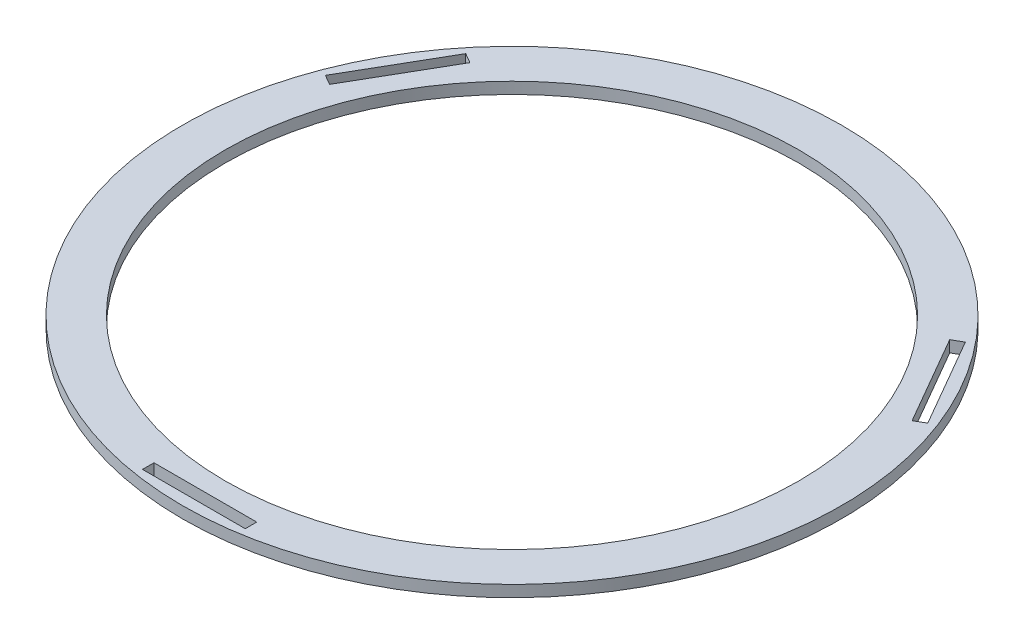
ISO-10303-21;
HEADER;
FILE_DESCRIPTION(('STEP AP214'),'2;1');
FILE_NAME('part.step','',(''),(''),'','','');
FILE_SCHEMA(('AUTOMOTIVE_DESIGN { 1 0 10303 214 1 1 1 1 }'));
ENDSEC;
DATA;
#1=APPLICATION_CONTEXT('core data for automotive mechanical design processes');
#2=APPLICATION_PROTOCOL_DEFINITION('international standard','automotive_design',2000,#1);
#3=PRODUCT_CONTEXT('',#1,'mechanical');
#4=PRODUCT('Part','Part','',(#3));
#5=PRODUCT_RELATED_PRODUCT_CATEGORY('part','',(#4));
#6=PRODUCT_DEFINITION_FORMATION('','',#4);
#7=PRODUCT_DEFINITION_CONTEXT('part definition',#1,'design');
#8=PRODUCT_DEFINITION('design','',#6,#7);
#9=PRODUCT_DEFINITION_SHAPE('','',#8);
#10=(LENGTH_UNIT() NAMED_UNIT(*) SI_UNIT(.MILLI.,.METRE.));
#11=(NAMED_UNIT(*) PLANE_ANGLE_UNIT() SI_UNIT($,.RADIAN.));
#12=(NAMED_UNIT(*) SI_UNIT($,.STERADIAN.) SOLID_ANGLE_UNIT());
#13=UNCERTAINTY_MEASURE_WITH_UNIT(LENGTH_MEASURE(1.E-05),#10,'distance_accuracy_value','');
#14=(GEOMETRIC_REPRESENTATION_CONTEXT(3) GLOBAL_UNCERTAINTY_ASSIGNED_CONTEXT((#13)) GLOBAL_UNIT_ASSIGNED_CONTEXT((#10,
#11,#12)) REPRESENTATION_CONTEXT('',''));
#15=CARTESIAN_POINT('',(0.,0.,0.));
#16=DIRECTION('',(0.,0.,1.));
#17=DIRECTION('',(1.,0.,0.));
#18=AXIS2_PLACEMENT_3D('',#15,#16,#17);
#19=CARTESIAN_POINT('',(0.,10.,0.));
#20=DIRECTION('',(0.,1.,0.));
#21=DIRECTION('',(0.,0.,1.));
#22=AXIS2_PLACEMENT_3D('',#19,#20,#21);
#23=PLANE('',#22);
#24=DIRECTION('',(-0.866025403784443,0.,-0.499999999999992));
#25=VECTOR('',#24,1.);
#26=CARTESIAN_POINT('',(-209.098874600424,10.,-172.430125386593));
#27=LINE('',#26,#25);
#28=CARTESIAN_POINT('',(-209.098874600424,10.,-172.430125386593));
#29=VERTEX_POINT('',#28);
#30=CARTESIAN_POINT('',(-217.759128638269,10.,-177.430125386593));
#31=VERTEX_POINT('',#30);
#32=EDGE_CURVE('E48',#29,#31,#27,.T.);
#33=ORIENTED_EDGE('',*,*,#32,.F.);
#34=DIRECTION('',(0.499999999999992,0.,-0.866025403784443));
#35=VECTOR('',#34,1.);
#36=CARTESIAN_POINT('',(-253.878306262739,10.,-94.869874613403));
#37=LINE('',#36,#35);
#38=CARTESIAN_POINT('',(-253.878306262739,10.,-94.869874613403));
#39=VERTEX_POINT('',#38);
#40=EDGE_CURVE('E140',#39,#29,#37,.T.);
#41=ORIENTED_EDGE('',*,*,#40,.F.);
#42=DIRECTION('',(0.866025403784443,0.,0.499999999999992));
#43=VECTOR('',#42,1.);
#44=CARTESIAN_POINT('',(-262.538560300584,10.,-99.8698746134029));
#45=LINE('',#44,#43);
#46=CARTESIAN_POINT('',(-262.538560300584,10.,-99.8698746134029));
#47=VERTEX_POINT('',#46);
#48=EDGE_CURVE('E143',#47,#39,#45,.T.);
#49=ORIENTED_EDGE('',*,*,#48,.F.);
#50=DIRECTION('',(-0.499999999999992,0.,0.866025403784443));
#51=VECTOR('',#50,1.);
#52=CARTESIAN_POINT('',(-217.759128638269,10.,-177.430125386593));
#53=LINE('',#52,#51);
#54=EDGE_CURVE('E149',#31,#47,#53,.T.);
#55=ORIENTED_EDGE('',*,*,#54,.F.);
#56=EDGE_LOOP('',(#33,#41,#49,#55));
#57=FACE_BOUND('',#56,.T.);
#58=DIRECTION('',(0.866025403784436,0.,-0.500000000000004));
#59=VECTOR('',#58,1.);
#60=CARTESIAN_POINT('',(253.878306262738,10.,-94.8698746134066));
#61=LINE('',#60,#59);
#62=CARTESIAN_POINT('',(253.878306262738,10.,-94.8698746134066));
#63=VERTEX_POINT('',#62);
#64=CARTESIAN_POINT('',(262.538560300582,10.,-99.8698746134066));
#65=VERTEX_POINT('',#64);
#66=EDGE_CURVE('E155',#63,#65,#61,.T.);
#67=ORIENTED_EDGE('',*,*,#66,.F.);
#68=DIRECTION('',(0.500000000000004,0.,0.866025403784436));
#69=VECTOR('',#68,1.);
#70=CARTESIAN_POINT('',(209.098874600422,10.,-172.430125386596));
#71=LINE('',#70,#69);
#72=CARTESIAN_POINT('',(209.098874600422,10.,-172.430125386596));
#73=VERTEX_POINT('',#72);
#74=EDGE_CURVE('E163',#73,#63,#71,.T.);
#75=ORIENTED_EDGE('',*,*,#74,.F.);
#76=DIRECTION('',(-0.866025403784436,0.,0.500000000000004));
#77=VECTOR('',#76,1.);
#78=CARTESIAN_POINT('',(217.759128638266,10.,-177.430125386596));
#79=LINE('',#78,#77);
#80=CARTESIAN_POINT('',(217.759128638266,10.,-177.430125386596));
#81=VERTEX_POINT('',#80);
#82=EDGE_CURVE('E177',#81,#73,#79,.T.);
#83=ORIENTED_EDGE('',*,*,#82,.F.);
#84=DIRECTION('',(-0.500000000000004,0.,-0.866025403784436));
#85=VECTOR('',#84,1.);
#86=CARTESIAN_POINT('',(262.538560300582,10.,-99.8698746134066));
#87=LINE('',#86,#85);
#88=EDGE_CURVE('E174',#65,#81,#87,.T.);
#89=ORIENTED_EDGE('',*,*,#88,.F.);
#90=EDGE_LOOP('',(#67,#75,#83,#89));
#91=FACE_BOUND('',#90,.T.);
#92=DIRECTION('',(0.,0.,1.));
#93=VECTOR('',#92,1.);
#94=CARTESIAN_POINT('',(-44.7794316623156,10.,267.3));
#95=LINE('',#94,#93);
#96=CARTESIAN_POINT('',(-44.7794316623156,10.,267.3));
#97=VERTEX_POINT('',#96);
#98=CARTESIAN_POINT('',(-44.7794316623156,10.,277.3));
#99=VERTEX_POINT('',#98);
#100=EDGE_CURVE('E184',#97,#99,#95,.T.);
#101=ORIENTED_EDGE('',*,*,#100,.F.);
#102=DIRECTION('',(-1.,0.,0.));
#103=VECTOR('',#102,1.);
#104=CARTESIAN_POINT('',(44.7794316623157,10.,267.3));
#105=LINE('',#104,#103);
#106=CARTESIAN_POINT('',(44.7794316623157,10.,267.3));
#107=VERTEX_POINT('',#106);
#108=EDGE_CURVE('E195',#107,#97,#105,.T.);
#109=ORIENTED_EDGE('',*,*,#108,.F.);
#110=DIRECTION('',(0.,0.,-1.));
#111=VECTOR('',#110,1.);
#112=CARTESIAN_POINT('',(44.7794316623157,10.,277.3));
#113=LINE('',#112,#111);
#114=CARTESIAN_POINT('',(44.7794316623157,10.,277.3));
#115=VERTEX_POINT('',#114);
#116=EDGE_CURVE('E209',#115,#107,#113,.T.);
#117=ORIENTED_EDGE('',*,*,#116,.F.);
#118=DIRECTION('',(1.,0.,0.));
#119=VECTOR('',#118,1.);
#120=CARTESIAN_POINT('',(-44.7794316623156,10.,277.3));
#121=LINE('',#120,#119);
#122=EDGE_CURVE('E206',#99,#115,#121,.T.);
#123=ORIENTED_EDGE('',*,*,#122,.F.);
#124=EDGE_LOOP('',(#101,#109,#117,#123));
#125=FACE_BOUND('',#124,.T.);
#126=CARTESIAN_POINT('',(0.,10.,0.));
#127=DIRECTION('',(0.,1.,0.));
#128=DIRECTION('',(0.,0.,1.));
#129=AXIS2_PLACEMENT_3D('',#126,#127,#128);
#130=CIRCLE('',#129,287.263450511895);
#131=CARTESIAN_POINT('',(0.,10.,287.263450511895));
#132=VERTEX_POINT('',#131);
#133=EDGE_CURVE('E11',#132,#132,#130,.T.);
#134=ORIENTED_EDGE('',*,*,#133,.T.);
#135=EDGE_LOOP('',(#134));
#136=FACE_BOUND('',#135,.T.);
#137=CARTESIAN_POINT('',(0.,10.,0.));
#138=DIRECTION('',(0.,1.,0.));
#139=DIRECTION('',(0.,0.,1.));
#140=AXIS2_PLACEMENT_3D('',#137,#138,#139);
#141=CIRCLE('',#140,250.);
#142=CARTESIAN_POINT('',(0.,10.,250.));
#143=VERTEX_POINT('',#142);
#144=EDGE_CURVE('E223',#143,#143,#141,.T.);
#145=ORIENTED_EDGE('',*,*,#144,.F.);
#146=EDGE_LOOP('',(#145));
#147=FACE_BOUND('',#146,.T.);
#148=ADVANCED_FACE('F33',(#57,#91,#125,#136,#147),#23,.T.);
#149=CARTESIAN_POINT('',(0.,0.,0.));
#150=DIRECTION('',(0.,1.,0.));
#151=DIRECTION('',(0.,0.,1.));
#152=AXIS2_PLACEMENT_3D('',#149,#150,#151);
#153=PLANE('',#152);
#154=DIRECTION('',(0.499999999999992,0.,-0.866025403784443));
#155=VECTOR('',#154,1.);
#156=CARTESIAN_POINT('',(-253.878306262739,0.,-94.869874613403));
#157=LINE('',#156,#155);
#158=CARTESIAN_POINT('',(-253.878306262739,0.,-94.869874613403));
#159=VERTEX_POINT('',#158);
#160=CARTESIAN_POINT('',(-209.098874600424,0.,-172.430125386593));
#161=VERTEX_POINT('',#160);
#162=EDGE_CURVE('E130',#159,#161,#157,.T.);
#163=ORIENTED_EDGE('',*,*,#162,.T.);
#164=DIRECTION('',(-0.866025403784443,0.,-0.499999999999992));
#165=VECTOR('',#164,1.);
#166=CARTESIAN_POINT('',(-209.098874600424,0.,-172.430125386593));
#167=LINE('',#166,#165);
#168=CARTESIAN_POINT('',(-217.759128638269,0.,-177.430125386593));
#169=VERTEX_POINT('',#168);
#170=EDGE_CURVE('E124',#161,#169,#167,.T.);
#171=ORIENTED_EDGE('',*,*,#170,.T.);
#172=DIRECTION('',(-0.499999999999992,0.,0.866025403784443));
#173=VECTOR('',#172,1.);
#174=CARTESIAN_POINT('',(-217.759128638269,0.,-177.430125386593));
#175=LINE('',#174,#173);
#176=CARTESIAN_POINT('',(-262.538560300584,0.,-99.8698746134029));
#177=VERTEX_POINT('',#176);
#178=EDGE_CURVE('E133',#169,#177,#175,.T.);
#179=ORIENTED_EDGE('',*,*,#178,.T.);
#180=DIRECTION('',(0.866025403784443,0.,0.499999999999992));
#181=VECTOR('',#180,1.);
#182=CARTESIAN_POINT('',(-262.538560300584,0.,-99.8698746134029));
#183=LINE('',#182,#181);
#184=EDGE_CURVE('E56',#177,#159,#183,.T.);
#185=ORIENTED_EDGE('',*,*,#184,.T.);
#186=EDGE_LOOP('',(#163,#171,#179,#185));
#187=FACE_BOUND('',#186,.T.);
#188=DIRECTION('',(0.500000000000004,0.,0.866025403784436));
#189=VECTOR('',#188,1.);
#190=CARTESIAN_POINT('',(209.098874600422,0.,-172.430125386596));
#191=LINE('',#190,#189);
#192=CARTESIAN_POINT('',(209.098874600422,0.,-172.430125386596));
#193=VERTEX_POINT('',#192);
#194=CARTESIAN_POINT('',(253.878306262738,0.,-94.8698746134066));
#195=VERTEX_POINT('',#194);
#196=EDGE_CURVE('E169',#193,#195,#191,.T.);
#197=ORIENTED_EDGE('',*,*,#196,.T.);
#198=DIRECTION('',(0.866025403784436,0.,-0.500000000000004));
#199=VECTOR('',#198,1.);
#200=CARTESIAN_POINT('',(253.878306262738,0.,-94.8698746134066));
#201=LINE('',#200,#199);
#202=CARTESIAN_POINT('',(262.538560300582,0.,-99.8698746134066));
#203=VERTEX_POINT('',#202);
#204=EDGE_CURVE('E159',#195,#203,#201,.T.);
#205=ORIENTED_EDGE('',*,*,#204,.T.);
#206=DIRECTION('',(-0.500000000000004,0.,-0.866025403784436));
#207=VECTOR('',#206,1.);
#208=CARTESIAN_POINT('',(262.538560300582,0.,-99.8698746134066));
#209=LINE('',#208,#207);
#210=CARTESIAN_POINT('',(217.759128638266,0.,-177.430125386596));
#211=VERTEX_POINT('',#210);
#212=EDGE_CURVE('E162',#203,#211,#209,.T.);
#213=ORIENTED_EDGE('',*,*,#212,.T.);
#214=DIRECTION('',(-0.866025403784436,0.,0.500000000000004));
#215=VECTOR('',#214,1.);
#216=CARTESIAN_POINT('',(217.759128638266,0.,-177.430125386596));
#217=LINE('',#216,#215);
#218=EDGE_CURVE('E166',#211,#193,#217,.T.);
#219=ORIENTED_EDGE('',*,*,#218,.T.);
#220=EDGE_LOOP('',(#197,#205,#213,#219));
#221=FACE_BOUND('',#220,.T.);
#222=DIRECTION('',(-1.,0.,0.));
#223=VECTOR('',#222,1.);
#224=CARTESIAN_POINT('',(44.7794316623157,0.,267.3));
#225=LINE('',#224,#223);
#226=CARTESIAN_POINT('',(44.7794316623157,0.,267.3));
#227=VERTEX_POINT('',#226);
#228=CARTESIAN_POINT('',(-44.7794316623156,0.,267.3));
#229=VERTEX_POINT('',#228);
#230=EDGE_CURVE('E201',#227,#229,#225,.T.);
#231=ORIENTED_EDGE('',*,*,#230,.T.);
#232=DIRECTION('',(0.,0.,1.));
#233=VECTOR('',#232,1.);
#234=CARTESIAN_POINT('',(-44.7794316623156,0.,267.3));
#235=LINE('',#234,#233);
#236=CARTESIAN_POINT('',(-44.7794316623156,0.,277.3));
#237=VERTEX_POINT('',#236);
#238=EDGE_CURVE('E191',#229,#237,#235,.T.);
#239=ORIENTED_EDGE('',*,*,#238,.T.);
#240=DIRECTION('',(1.,0.,0.));
#241=VECTOR('',#240,1.);
#242=CARTESIAN_POINT('',(-44.7794316623156,0.,277.3));
#243=LINE('',#242,#241);
#244=CARTESIAN_POINT('',(44.7794316623157,0.,277.3));
#245=VERTEX_POINT('',#244);
#246=EDGE_CURVE('E194',#237,#245,#243,.T.);
#247=ORIENTED_EDGE('',*,*,#246,.T.);
#248=DIRECTION('',(0.,0.,-1.));
#249=VECTOR('',#248,1.);
#250=CARTESIAN_POINT('',(44.7794316623157,0.,277.3));
#251=LINE('',#250,#249);
#252=EDGE_CURVE('E198',#245,#227,#251,.T.);
#253=ORIENTED_EDGE('',*,*,#252,.T.);
#254=EDGE_LOOP('',(#231,#239,#247,#253));
#255=FACE_BOUND('',#254,.T.);
#256=CARTESIAN_POINT('',(0.,0.,0.));
#257=DIRECTION('',(0.,1.,0.));
#258=DIRECTION('',(0.,0.,1.));
#259=AXIS2_PLACEMENT_3D('',#256,#257,#258);
#260=CIRCLE('',#259,287.263450511895);
#261=CARTESIAN_POINT('',(0.,0.,287.263450511895));
#262=VERTEX_POINT('',#261);
#263=EDGE_CURVE('E37',#262,#262,#260,.T.);
#264=ORIENTED_EDGE('',*,*,#263,.F.);
#265=EDGE_LOOP('',(#264));
#266=FACE_BOUND('',#265,.T.);
#267=CARTESIAN_POINT('',(0.,0.,0.));
#268=DIRECTION('',(0.,1.,0.));
#269=DIRECTION('',(0.,0.,1.));
#270=AXIS2_PLACEMENT_3D('',#267,#268,#269);
#271=CIRCLE('',#270,250.);
#272=CARTESIAN_POINT('',(0.,0.,250.));
#273=VERTEX_POINT('',#272);
#274=EDGE_CURVE('E216',#273,#273,#271,.T.);
#275=ORIENTED_EDGE('',*,*,#274,.T.);
#276=EDGE_LOOP('',(#275));
#277=FACE_BOUND('',#276,.T.);
#278=ADVANCED_FACE('F137',(#187,#221,#255,#266,#277),#153,.F.);
#279=CARTESIAN_POINT('',(0.,10.,0.));
#280=DIRECTION('',(0.,-1.,0.));
#281=DIRECTION('',(0.,0.,-1.));
#282=AXIS2_PLACEMENT_3D('',#279,#280,#281);
#283=CYLINDRICAL_SURFACE('',#282,287.263450511895);
#284=ORIENTED_EDGE('',*,*,#133,.F.);
#285=EDGE_LOOP('',(#284));
#286=FACE_BOUND('',#285,.T.);
#287=ORIENTED_EDGE('',*,*,#263,.T.);
#288=EDGE_LOOP('',(#287));
#289=FACE_BOUND('',#288,.T.);
#290=ADVANCED_FACE('F35',(#286,#289),#283,.T.);
#291=CARTESIAN_POINT('',(0.,10.,0.));
#292=DIRECTION('',(0.,-1.,0.));
#293=DIRECTION('',(0.,0.,-1.));
#294=AXIS2_PLACEMENT_3D('',#291,#292,#293);
#295=CYLINDRICAL_SURFACE('',#294,250.);
#296=ORIENTED_EDGE('',*,*,#144,.T.);
#297=EDGE_LOOP('',(#296));
#298=FACE_BOUND('',#297,.T.);
#299=ORIENTED_EDGE('',*,*,#274,.F.);
#300=EDGE_LOOP('',(#299));
#301=FACE_BOUND('',#300,.T.);
#302=ADVANCED_FACE('F230',(#298,#301),#295,.F.);
#303=CARTESIAN_POINT('',(-44.7794316623156,0.,267.3));
#304=DIRECTION('',(-1.,0.,0.));
#305=DIRECTION('',(0.,0.,1.));
#306=AXIS2_PLACEMENT_3D('',#303,#304,#305);
#307=PLANE('',#306);
#308=ORIENTED_EDGE('',*,*,#100,.T.);
#309=DIRECTION('',(0.,1.,0.));
#310=VECTOR('',#309,1.);
#311=CARTESIAN_POINT('',(-44.7794316623156,0.,277.3));
#312=LINE('',#311,#310);
#313=EDGE_CURVE('E204',#237,#99,#312,.T.);
#314=ORIENTED_EDGE('',*,*,#313,.F.);
#315=ORIENTED_EDGE('',*,*,#238,.F.);
#316=DIRECTION('',(0.,1.,0.));
#317=VECTOR('',#316,1.);
#318=CARTESIAN_POINT('',(-44.7794316623156,0.,267.3));
#319=LINE('',#318,#317);
#320=EDGE_CURVE('E214',#229,#97,#319,.T.);
#321=ORIENTED_EDGE('',*,*,#320,.T.);
#322=EDGE_LOOP('',(#308,#314,#315,#321));
#323=FACE_BOUND('',#322,.T.);
#324=ADVANCED_FACE('F232',(#323),#307,.F.);
#325=CARTESIAN_POINT('',(44.7794316623157,0.,267.3));
#326=DIRECTION('',(0.,0.,-1.));
#327=DIRECTION('',(-1.,0.,0.));
#328=AXIS2_PLACEMENT_3D('',#325,#326,#327);
#329=PLANE('',#328);
#330=ORIENTED_EDGE('',*,*,#108,.T.);
#331=ORIENTED_EDGE('',*,*,#320,.F.);
#332=ORIENTED_EDGE('',*,*,#230,.F.);
#333=DIRECTION('',(0.,1.,0.));
#334=VECTOR('',#333,1.);
#335=CARTESIAN_POINT('',(44.7794316623157,0.,267.3));
#336=LINE('',#335,#334);
#337=EDGE_CURVE('E217',#227,#107,#336,.T.);
#338=ORIENTED_EDGE('',*,*,#337,.T.);
#339=EDGE_LOOP('',(#330,#331,#332,#338));
#340=FACE_BOUND('',#339,.T.);
#341=ADVANCED_FACE('F239',(#340),#329,.F.);
#342=CARTESIAN_POINT('',(44.7794316623157,0.,277.3));
#343=DIRECTION('',(1.,0.,0.));
#344=DIRECTION('',(0.,0.,-1.));
#345=AXIS2_PLACEMENT_3D('',#342,#343,#344);
#346=PLANE('',#345);
#347=ORIENTED_EDGE('',*,*,#116,.T.);
#348=ORIENTED_EDGE('',*,*,#337,.F.);
#349=ORIENTED_EDGE('',*,*,#252,.F.);
#350=DIRECTION('',(0.,1.,0.));
#351=VECTOR('',#350,1.);
#352=CARTESIAN_POINT('',(44.7794316623157,0.,277.3));
#353=LINE('',#352,#351);
#354=EDGE_CURVE('E219',#245,#115,#353,.T.);
#355=ORIENTED_EDGE('',*,*,#354,.T.);
#356=EDGE_LOOP('',(#347,#348,#349,#355));
#357=FACE_BOUND('',#356,.T.);
#358=ADVANCED_FACE('F276',(#357),#346,.F.);
#359=CARTESIAN_POINT('',(-44.7794316623156,0.,277.3));
#360=DIRECTION('',(0.,0.,1.));
#361=DIRECTION('',(1.,0.,0.));
#362=AXIS2_PLACEMENT_3D('',#359,#360,#361);
#363=PLANE('',#362);
#364=ORIENTED_EDGE('',*,*,#122,.T.);
#365=ORIENTED_EDGE('',*,*,#354,.F.);
#366=ORIENTED_EDGE('',*,*,#246,.F.);
#367=ORIENTED_EDGE('',*,*,#313,.T.);
#368=EDGE_LOOP('',(#364,#365,#366,#367));
#369=FACE_BOUND('',#368,.T.);
#370=ADVANCED_FACE('F270',(#369),#363,.F.);
#371=CARTESIAN_POINT('',(253.878306262738,0.,-94.8698746134066));
#372=DIRECTION('',(0.500000000000004,0.,0.866025403784436));
#373=DIRECTION('',(0.866025403784436,0.,-0.500000000000004));
#374=AXIS2_PLACEMENT_3D('',#371,#372,#373);
#375=PLANE('',#374);
#376=ORIENTED_EDGE('',*,*,#66,.T.);
#377=DIRECTION('',(0.,1.,0.));
#378=VECTOR('',#377,1.);
#379=CARTESIAN_POINT('',(262.538560300582,0.,-99.8698746134066));
#380=LINE('',#379,#378);
#381=EDGE_CURVE('E172',#203,#65,#380,.T.);
#382=ORIENTED_EDGE('',*,*,#381,.F.);
#383=ORIENTED_EDGE('',*,*,#204,.F.);
#384=DIRECTION('',(0.,1.,0.));
#385=VECTOR('',#384,1.);
#386=CARTESIAN_POINT('',(253.878306262738,0.,-94.8698746134066));
#387=LINE('',#386,#385);
#388=EDGE_CURVE('E182',#195,#63,#387,.T.);
#389=ORIENTED_EDGE('',*,*,#388,.T.);
#390=EDGE_LOOP('',(#376,#382,#383,#389));
#391=FACE_BOUND('',#390,.T.);
#392=ADVANCED_FACE('F283',(#391),#375,.F.);
#393=CARTESIAN_POINT('',(209.098874600422,0.,-172.430125386596));
#394=DIRECTION('',(-0.866025403784436,0.,0.500000000000004));
#395=DIRECTION('',(0.500000000000004,0.,0.866025403784436));
#396=AXIS2_PLACEMENT_3D('',#393,#394,#395);
#397=PLANE('',#396);
#398=ORIENTED_EDGE('',*,*,#74,.T.);
#399=ORIENTED_EDGE('',*,*,#388,.F.);
#400=ORIENTED_EDGE('',*,*,#196,.F.);
#401=DIRECTION('',(0.,1.,0.));
#402=VECTOR('',#401,1.);
#403=CARTESIAN_POINT('',(209.098874600422,0.,-172.430125386596));
#404=LINE('',#403,#402);
#405=EDGE_CURVE('E185',#193,#73,#404,.T.);
#406=ORIENTED_EDGE('',*,*,#405,.T.);
#407=EDGE_LOOP('',(#398,#399,#400,#406));
#408=FACE_BOUND('',#407,.T.);
#409=ADVANCED_FACE('F289',(#408),#397,.F.);
#410=CARTESIAN_POINT('',(217.759128638266,0.,-177.430125386596));
#411=DIRECTION('',(-0.500000000000004,0.,-0.866025403784436));
#412=DIRECTION('',(-0.866025403784436,0.,0.500000000000004));
#413=AXIS2_PLACEMENT_3D('',#410,#411,#412);
#414=PLANE('',#413);
#415=ORIENTED_EDGE('',*,*,#82,.T.);
#416=ORIENTED_EDGE('',*,*,#405,.F.);
#417=ORIENTED_EDGE('',*,*,#218,.F.);
#418=DIRECTION('',(0.,1.,0.));
#419=VECTOR('',#418,1.);
#420=CARTESIAN_POINT('',(217.759128638266,0.,-177.430125386596));
#421=LINE('',#420,#419);
#422=EDGE_CURVE('E187',#211,#81,#421,.T.);
#423=ORIENTED_EDGE('',*,*,#422,.T.);
#424=EDGE_LOOP('',(#415,#416,#417,#423));
#425=FACE_BOUND('',#424,.T.);
#426=ADVANCED_FACE('F294',(#425),#414,.F.);
#427=CARTESIAN_POINT('',(262.538560300582,0.,-99.8698746134066));
#428=DIRECTION('',(0.866025403784436,0.,-0.500000000000004));
#429=DIRECTION('',(-0.500000000000004,0.,-0.866025403784436));
#430=AXIS2_PLACEMENT_3D('',#427,#428,#429);
#431=PLANE('',#430);
#432=ORIENTED_EDGE('',*,*,#88,.T.);
#433=ORIENTED_EDGE('',*,*,#422,.F.);
#434=ORIENTED_EDGE('',*,*,#212,.F.);
#435=ORIENTED_EDGE('',*,*,#381,.T.);
#436=EDGE_LOOP('',(#432,#433,#434,#435));
#437=FACE_BOUND('',#436,.T.);
#438=ADVANCED_FACE('F291',(#437),#431,.F.);
#439=CARTESIAN_POINT('',(-209.098874600424,0.,-172.430125386593));
#440=DIRECTION('',(0.499999999999992,0.,-0.866025403784443));
#441=DIRECTION('',(-0.866025403784443,0.,-0.499999999999992));
#442=AXIS2_PLACEMENT_3D('',#439,#440,#441);
#443=PLANE('',#442);
#444=ORIENTED_EDGE('',*,*,#32,.T.);
#445=DIRECTION('',(0.,1.,0.));
#446=VECTOR('',#445,1.);
#447=CARTESIAN_POINT('',(-217.759128638269,0.,-177.430125386593));
#448=LINE('',#447,#446);
#449=EDGE_CURVE('E120',#169,#31,#448,.T.);
#450=ORIENTED_EDGE('',*,*,#449,.F.);
#451=ORIENTED_EDGE('',*,*,#170,.F.);
#452=DIRECTION('',(0.,1.,0.));
#453=VECTOR('',#452,1.);
#454=CARTESIAN_POINT('',(-209.098874600424,0.,-172.430125386593));
#455=LINE('',#454,#453);
#456=EDGE_CURVE('E153',#161,#29,#455,.T.);
#457=ORIENTED_EDGE('',*,*,#456,.T.);
#458=EDGE_LOOP('',(#444,#450,#451,#457));
#459=FACE_BOUND('',#458,.T.);
#460=ADVANCED_FACE('F122',(#459),#443,.F.);
#461=CARTESIAN_POINT('',(-253.878306262739,0.,-94.869874613403));
#462=DIRECTION('',(0.866025403784443,0.,0.499999999999992));
#463=DIRECTION('',(0.499999999999992,0.,-0.866025403784443));
#464=AXIS2_PLACEMENT_3D('',#461,#462,#463);
#465=PLANE('',#464);
#466=ORIENTED_EDGE('',*,*,#40,.T.);
#467=ORIENTED_EDGE('',*,*,#456,.F.);
#468=ORIENTED_EDGE('',*,*,#162,.F.);
#469=DIRECTION('',(0.,1.,0.));
#470=VECTOR('',#469,1.);
#471=CARTESIAN_POINT('',(-253.878306262739,0.,-94.869874613403));
#472=LINE('',#471,#470);
#473=EDGE_CURVE('E156',#159,#39,#472,.T.);
#474=ORIENTED_EDGE('',*,*,#473,.T.);
#475=EDGE_LOOP('',(#466,#467,#468,#474));
#476=FACE_BOUND('',#475,.T.);
#477=ADVANCED_FACE('F304',(#476),#465,.F.);
#478=CARTESIAN_POINT('',(-262.538560300584,0.,-99.8698746134029));
#479=DIRECTION('',(-0.499999999999992,0.,0.866025403784443));
#480=DIRECTION('',(0.866025403784443,0.,0.499999999999992));
#481=AXIS2_PLACEMENT_3D('',#478,#479,#480);
#482=PLANE('',#481);
#483=ORIENTED_EDGE('',*,*,#48,.T.);
#484=ORIENTED_EDGE('',*,*,#473,.F.);
#485=ORIENTED_EDGE('',*,*,#184,.F.);
#486=DIRECTION('',(0.,1.,0.));
#487=VECTOR('',#486,1.);
#488=CARTESIAN_POINT('',(-262.538560300584,0.,-99.8698746134029));
#489=LINE('',#488,#487);
#490=EDGE_CURVE('E129',#177,#47,#489,.T.);
#491=ORIENTED_EDGE('',*,*,#490,.T.);
#492=EDGE_LOOP('',(#483,#484,#485,#491));
#493=FACE_BOUND('',#492,.T.);
#494=ADVANCED_FACE('F307',(#493),#482,.F.);
#495=CARTESIAN_POINT('',(-217.759128638269,0.,-177.430125386593));
#496=DIRECTION('',(-0.866025403784443,0.,-0.499999999999992));
#497=DIRECTION('',(-0.499999999999992,0.,0.866025403784443));
#498=AXIS2_PLACEMENT_3D('',#495,#496,#497);
#499=PLANE('',#498);
#500=ORIENTED_EDGE('',*,*,#54,.T.);
#501=ORIENTED_EDGE('',*,*,#490,.F.);
#502=ORIENTED_EDGE('',*,*,#178,.F.);
#503=ORIENTED_EDGE('',*,*,#449,.T.);
#504=EDGE_LOOP('',(#500,#501,#502,#503));
#505=FACE_BOUND('',#504,.T.);
#506=ADVANCED_FACE('F134',(#505),#499,.F.);
#507=CLOSED_SHELL('',(#148,#278,#290,#302,#324,#341,#358,#370,#392,#409,#426,#438,#460,#477,
#494,#506));
#508=MANIFOLD_SOLID_BREP('B2',#507);
#509=ADVANCED_BREP_SHAPE_REPRESENTATION('',(#18,#508),#14);
#510=SHAPE_DEFINITION_REPRESENTATION(#9,#509);
ENDSEC;
END-ISO-10303-21;
